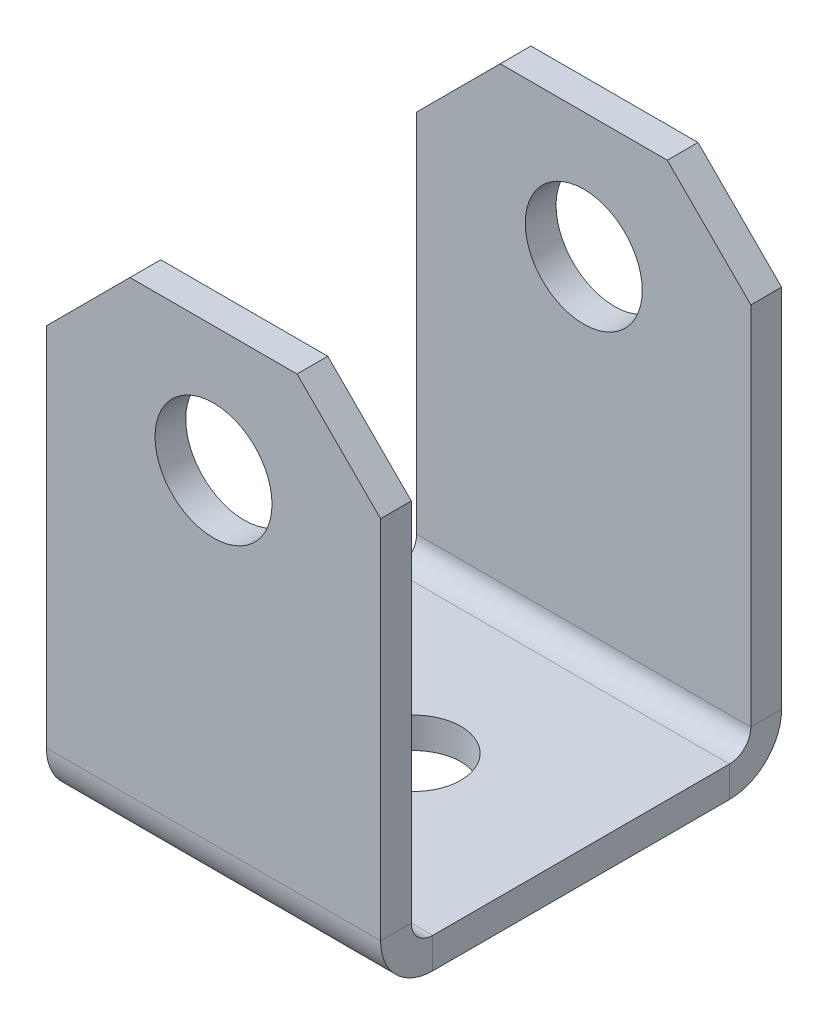
ISO-10303-21;
HEADER;
FILE_DESCRIPTION(('STEP AP214'),'2;1');
FILE_NAME('part.step','',(''),(''),'','','');
FILE_SCHEMA(('AUTOMOTIVE_DESIGN { 1 0 10303 214 1 1 1 1 }'));
ENDSEC;
DATA;
#1=APPLICATION_CONTEXT('core data for automotive mechanical design processes');
#2=APPLICATION_PROTOCOL_DEFINITION('international standard','automotive_design',2000,#1);
#3=PRODUCT_CONTEXT('',#1,'mechanical');
#4=PRODUCT('Part','Part','',(#3));
#5=PRODUCT_RELATED_PRODUCT_CATEGORY('part','',(#4));
#6=PRODUCT_DEFINITION_FORMATION('','',#4);
#7=PRODUCT_DEFINITION_CONTEXT('part definition',#1,'design');
#8=PRODUCT_DEFINITION('design','',#6,#7);
#9=PRODUCT_DEFINITION_SHAPE('','',#8);
#10=(LENGTH_UNIT() NAMED_UNIT(*) SI_UNIT(.MILLI.,.METRE.));
#11=(NAMED_UNIT(*) PLANE_ANGLE_UNIT() SI_UNIT($,.RADIAN.));
#12=(NAMED_UNIT(*) SI_UNIT($,.STERADIAN.) SOLID_ANGLE_UNIT());
#13=UNCERTAINTY_MEASURE_WITH_UNIT(LENGTH_MEASURE(1.E-05),#10,'distance_accuracy_value','');
#14=(GEOMETRIC_REPRESENTATION_CONTEXT(3) GLOBAL_UNCERTAINTY_ASSIGNED_CONTEXT((#13)) GLOBAL_UNIT_ASSIGNED_CONTEXT((#10,
#11,#12)) REPRESENTATION_CONTEXT('',''));
#15=CARTESIAN_POINT('',(0.,0.,0.));
#16=DIRECTION('',(0.,0.,1.));
#17=DIRECTION('',(1.,0.,0.));
#18=AXIS2_PLACEMENT_3D('',#15,#16,#17);
#19=CARTESIAN_POINT('',(-3.175,9.525,-7.62));
#20=DIRECTION('',(0.707106781186549,-0.707106781186546,0.));
#21=DIRECTION('',(0.,0.,-1.));
#22=AXIS2_PLACEMENT_3D('',#19,#20,#21);
#23=PLANE('',#22);
#24=DIRECTION('',(0.707106781186546,0.707106781186549,0.));
#25=VECTOR('',#24,1.);
#26=CARTESIAN_POINT('',(-3.175,9.525,-7.62));
#27=LINE('',#26,#25);
#28=CARTESIAN_POINT('',(-6.35,6.35,-7.62));
#29=VERTEX_POINT('',#28);
#30=CARTESIAN_POINT('',(-3.175,9.525,-7.62));
#31=VERTEX_POINT('',#30);
#32=EDGE_CURVE('E168',#29,#31,#27,.T.);
#33=ORIENTED_EDGE('',*,*,#32,.F.);
#34=DIRECTION('',(0.,0.,-1.));
#35=VECTOR('',#34,1.);
#36=CARTESIAN_POINT('',(-6.35,6.35,-7.62));
#37=LINE('',#36,#35);
#38=CARTESIAN_POINT('',(-6.35,6.35,-6.4516));
#39=VERTEX_POINT('',#38);
#40=EDGE_CURVE('E293',#39,#29,#37,.T.);
#41=ORIENTED_EDGE('',*,*,#40,.F.);
#42=DIRECTION('',(-0.707106781186546,-0.707106781186549,0.));
#43=VECTOR('',#42,1.);
#44=CARTESIAN_POINT('',(-13.7033,-1.00330000000004,-6.4516));
#45=LINE('',#44,#43);
#46=CARTESIAN_POINT('',(-3.175,9.525,-6.4516));
#47=VERTEX_POINT('',#46);
#48=EDGE_CURVE('E225',#47,#39,#45,.T.);
#49=ORIENTED_EDGE('',*,*,#48,.F.);
#50=DIRECTION('',(0.,0.,1.));
#51=VECTOR('',#50,1.);
#52=CARTESIAN_POINT('',(-3.175,9.525,-7.62));
#53=LINE('',#52,#51);
#54=EDGE_CURVE('E224',#31,#47,#53,.T.);
#55=ORIENTED_EDGE('',*,*,#54,.F.);
#56=EDGE_LOOP('',(#33,#41,#49,#55));
#57=FACE_BOUND('',#56,.T.);
#58=ADVANCED_FACE('F14',(#57),#23,.F.);
#59=CARTESIAN_POINT('',(-6.35,6.35,7.62));
#60=DIRECTION('',(0.707106781186546,-0.707106781186549,0.));
#61=DIRECTION('',(0.,0.,-1.));
#62=AXIS2_PLACEMENT_3D('',#59,#60,#61);
#63=PLANE('',#62);
#64=DIRECTION('',(-0.707106781186549,-0.707106781186546,0.));
#65=VECTOR('',#64,1.);
#66=CARTESIAN_POINT('',(-6.35,6.35,7.62));
#67=LINE('',#66,#65);
#68=CARTESIAN_POINT('',(-3.175,9.525,7.62));
#69=VERTEX_POINT('',#68);
#70=CARTESIAN_POINT('',(-6.35,6.35,7.62));
#71=VERTEX_POINT('',#70);
#72=EDGE_CURVE('E245',#69,#71,#67,.T.);
#73=ORIENTED_EDGE('',*,*,#72,.F.);
#74=DIRECTION('',(0.,0.,1.));
#75=VECTOR('',#74,1.);
#76=CARTESIAN_POINT('',(-3.175,9.525,7.62));
#77=LINE('',#76,#75);
#78=CARTESIAN_POINT('',(-3.175,9.525,6.4516));
#79=VERTEX_POINT('',#78);
#80=EDGE_CURVE('E9',#79,#69,#77,.T.);
#81=ORIENTED_EDGE('',*,*,#80,.F.);
#82=DIRECTION('',(0.707106781186549,0.707106781186546,0.));
#83=VECTOR('',#82,1.);
#84=CARTESIAN_POINT('',(-7.3533,5.3467,6.4516));
#85=LINE('',#84,#83);
#86=CARTESIAN_POINT('',(-6.35,6.35,6.4516));
#87=VERTEX_POINT('',#86);
#88=EDGE_CURVE('E181',#87,#79,#85,.T.);
#89=ORIENTED_EDGE('',*,*,#88,.F.);
#90=DIRECTION('',(0.,0.,-1.));
#91=VECTOR('',#90,1.);
#92=CARTESIAN_POINT('',(-6.35,6.35,7.62));
#93=LINE('',#92,#91);
#94=EDGE_CURVE('E219',#71,#87,#93,.T.);
#95=ORIENTED_EDGE('',*,*,#94,.F.);
#96=EDGE_LOOP('',(#73,#81,#89,#95));
#97=FACE_BOUND('',#96,.T.);
#98=ADVANCED_FACE('F522',(#97),#63,.F.);
#99=CARTESIAN_POINT('',(3.175,9.525,7.62));
#100=DIRECTION('',(-0.707106781186549,-0.707106781186546,0.));
#101=DIRECTION('',(-0.707106781186546,0.707106781186549,0.));
#102=AXIS2_PLACEMENT_3D('',#99,#100,#101);
#103=PLANE('',#102);
#104=DIRECTION('',(-0.707106781186546,0.707106781186549,0.));
#105=VECTOR('',#104,1.);
#106=CARTESIAN_POINT('',(3.175,9.525,7.62));
#107=LINE('',#106,#105);
#108=CARTESIAN_POINT('',(6.35,6.35,7.62));
#109=VERTEX_POINT('',#108);
#110=CARTESIAN_POINT('',(3.175,9.525,7.62));
#111=VERTEX_POINT('',#110);
#112=EDGE_CURVE('E218',#109,#111,#107,.T.);
#113=ORIENTED_EDGE('',*,*,#112,.F.);
#114=DIRECTION('',(0.,0.,1.));
#115=VECTOR('',#114,1.);
#116=CARTESIAN_POINT('',(6.35,6.35,7.62));
#117=LINE('',#116,#115);
#118=CARTESIAN_POINT('',(6.35,6.35,6.4516));
#119=VERTEX_POINT('',#118);
#120=EDGE_CURVE('E162',#119,#109,#117,.T.);
#121=ORIENTED_EDGE('',*,*,#120,.F.);
#122=DIRECTION('',(0.707106781186546,-0.707106781186549,0.));
#123=VECTOR('',#122,1.);
#124=CARTESIAN_POINT('',(13.7033,-1.00330000000003,6.4516));
#125=LINE('',#124,#123);
#126=CARTESIAN_POINT('',(3.175,9.525,6.4516));
#127=VERTEX_POINT('',#126);
#128=EDGE_CURVE('E240',#127,#119,#125,.T.);
#129=ORIENTED_EDGE('',*,*,#128,.F.);
#130=DIRECTION('',(0.,0.,-1.));
#131=VECTOR('',#130,1.);
#132=CARTESIAN_POINT('',(3.175,9.525,7.62));
#133=LINE('',#132,#131);
#134=EDGE_CURVE('E25',#111,#127,#133,.T.);
#135=ORIENTED_EDGE('',*,*,#134,.F.);
#136=EDGE_LOOP('',(#113,#121,#129,#135));
#137=FACE_BOUND('',#136,.T.);
#138=ADVANCED_FACE('F514',(#137),#103,.F.);
#139=CARTESIAN_POINT('',(6.35,6.35,-7.62));
#140=DIRECTION('',(-0.707106781186546,-0.707106781186549,0.));
#141=DIRECTION('',(-0.707106781186549,0.707106781186546,0.));
#142=AXIS2_PLACEMENT_3D('',#139,#140,#141);
#143=PLANE('',#142);
#144=DIRECTION('',(0.707106781186549,-0.707106781186546,0.));
#145=VECTOR('',#144,1.);
#146=CARTESIAN_POINT('',(6.35,6.35,-7.62));
#147=LINE('',#146,#145);
#148=CARTESIAN_POINT('',(3.175,9.525,-7.62));
#149=VERTEX_POINT('',#148);
#150=CARTESIAN_POINT('',(6.35,6.35,-7.62));
#151=VERTEX_POINT('',#150);
#152=EDGE_CURVE('E173',#149,#151,#147,.T.);
#153=ORIENTED_EDGE('',*,*,#152,.F.);
#154=DIRECTION('',(0.,0.,-1.));
#155=VECTOR('',#154,1.);
#156=CARTESIAN_POINT('',(3.175,9.525,-7.62));
#157=LINE('',#156,#155);
#158=CARTESIAN_POINT('',(3.175,9.525,-6.4516));
#159=VERTEX_POINT('',#158);
#160=EDGE_CURVE('E220',#159,#149,#157,.T.);
#161=ORIENTED_EDGE('',*,*,#160,.F.);
#162=DIRECTION('',(-0.707106781186549,0.707106781186546,0.));
#163=VECTOR('',#162,1.);
#164=CARTESIAN_POINT('',(7.3533,5.3467,-6.4516));
#165=LINE('',#164,#163);
#166=CARTESIAN_POINT('',(6.35,6.35,-6.4516));
#167=VERTEX_POINT('',#166);
#168=EDGE_CURVE('E172',#167,#159,#165,.T.);
#169=ORIENTED_EDGE('',*,*,#168,.F.);
#170=DIRECTION('',(0.,0.,1.));
#171=VECTOR('',#170,1.);
#172=CARTESIAN_POINT('',(6.35,6.35,-7.62));
#173=LINE('',#172,#171);
#174=EDGE_CURVE('E269',#151,#167,#173,.T.);
#175=ORIENTED_EDGE('',*,*,#174,.F.);
#176=EDGE_LOOP('',(#153,#161,#169,#175));
#177=FACE_BOUND('',#176,.T.);
#178=ADVANCED_FACE('F582',(#177),#143,.F.);
#179=CARTESIAN_POINT('',(-6.35,9.525,7.62));
#180=DIRECTION('',(0.,-1.,0.));
#181=DIRECTION('',(0.,0.,-1.));
#182=AXIS2_PLACEMENT_3D('',#179,#180,#181);
#183=PLANE('',#182);
#184=DIRECTION('',(-1.,0.,0.));
#185=VECTOR('',#184,1.);
#186=CARTESIAN_POINT('',(6.35,9.525,7.62));
#187=LINE('',#186,#185);
#188=EDGE_CURVE('E241',#111,#69,#187,.T.);
#189=ORIENTED_EDGE('',*,*,#188,.F.);
#190=ORIENTED_EDGE('',*,*,#134,.T.);
#191=DIRECTION('',(-1.,0.,0.));
#192=VECTOR('',#191,1.);
#193=CARTESIAN_POINT('',(-6.35,9.525,6.4516));
#194=LINE('',#193,#192);
#195=EDGE_CURVE('E304',#127,#79,#194,.T.);
#196=ORIENTED_EDGE('',*,*,#195,.T.);
#197=ORIENTED_EDGE('',*,*,#80,.T.);
#198=EDGE_LOOP('',(#189,#190,#196,#197));
#199=FACE_BOUND('',#198,.T.);
#200=ADVANCED_FACE('F517',(#199),#183,.F.);
#201=CARTESIAN_POINT('',(6.35,-8.3566,6.4516));
#202=DIRECTION('',(0.,0.,-1.));
#203=DIRECTION('',(0.,-1.,0.));
#204=AXIS2_PLACEMENT_3D('',#201,#202,#203);
#205=PLANE('',#204);
#206=CARTESIAN_POINT('',(0.,4.7625,6.4516));
#207=DIRECTION('',(0.,0.,-1.));
#208=DIRECTION('',(-1.,0.,0.));
#209=AXIS2_PLACEMENT_3D('',#206,#207,#208);
#210=CIRCLE('',#209,2.2225);
#211=CARTESIAN_POINT('',(2.2225,4.7625,6.4516));
#212=VERTEX_POINT('',#211);
#213=CARTESIAN_POINT('',(-2.2225,4.7625,6.4516));
#214=VERTEX_POINT('',#213);
#215=EDGE_CURVE('E185',#212,#214,#210,.T.);
#216=ORIENTED_EDGE('',*,*,#215,.F.);
#217=CARTESIAN_POINT('',(0.,4.7625,6.4516));
#218=DIRECTION('',(0.,0.,-1.));
#219=DIRECTION('',(-1.,0.,0.));
#220=AXIS2_PLACEMENT_3D('',#217,#218,#219);
#221=CIRCLE('',#220,2.2225);
#222=EDGE_CURVE('E263',#214,#212,#221,.T.);
#223=ORIENTED_EDGE('',*,*,#222,.F.);
#224=EDGE_LOOP('',(#216,#223));
#225=FACE_BOUND('',#224,.T.);
#226=ORIENTED_EDGE('',*,*,#195,.F.);
#227=ORIENTED_EDGE('',*,*,#128,.T.);
#228=DIRECTION('',(0.,1.,0.));
#229=VECTOR('',#228,1.);
#230=CARTESIAN_POINT('',(6.35,9.525,6.4516));
#231=LINE('',#230,#229);
#232=CARTESIAN_POINT('',(6.35,-7.5438,6.4516));
#233=VERTEX_POINT('',#232);
#234=EDGE_CURVE('E167',#233,#119,#231,.T.);
#235=ORIENTED_EDGE('',*,*,#234,.F.);
#236=DIRECTION('',(1.,0.,0.));
#237=VECTOR('',#236,1.);
#238=CARTESIAN_POINT('',(-6.35,-7.5438,6.4516));
#239=LINE('',#238,#237);
#240=CARTESIAN_POINT('',(-6.35,-7.5438,6.4516));
#241=VERTEX_POINT('',#240);
#242=EDGE_CURVE('E253',#241,#233,#239,.T.);
#243=ORIENTED_EDGE('',*,*,#242,.F.);
#244=DIRECTION('',(0.,-1.,0.));
#245=VECTOR('',#244,1.);
#246=CARTESIAN_POINT('',(-6.35,-8.3566,6.4516));
#247=LINE('',#246,#245);
#248=EDGE_CURVE('E214',#87,#241,#247,.T.);
#249=ORIENTED_EDGE('',*,*,#248,.F.);
#250=ORIENTED_EDGE('',*,*,#88,.T.);
#251=EDGE_LOOP('',(#226,#227,#235,#243,#249,#250));
#252=FACE_BOUND('',#251,.T.);
#253=ADVANCED_FACE('F504',(#225,#252),#205,.T.);
#254=CARTESIAN_POINT('',(6.35,-8.3566,7.62));
#255=DIRECTION('',(0.,0.,-1.));
#256=DIRECTION('',(0.,-1.,0.));
#257=AXIS2_PLACEMENT_3D('',#254,#255,#256);
#258=PLANE('',#257);
#259=CARTESIAN_POINT('',(0.,4.7625,7.62));
#260=DIRECTION('',(0.,0.,1.));
#261=DIRECTION('',(1.,0.,0.));
#262=AXIS2_PLACEMENT_3D('',#259,#260,#261);
#263=CIRCLE('',#262,2.2225);
#264=CARTESIAN_POINT('',(2.2225,4.7625,7.62));
#265=VERTEX_POINT('',#264);
#266=CARTESIAN_POINT('',(-2.2225,4.7625,7.62));
#267=VERTEX_POINT('',#266);
#268=EDGE_CURVE('E140',#265,#267,#263,.T.);
#269=ORIENTED_EDGE('',*,*,#268,.F.);
#270=CARTESIAN_POINT('',(0.,4.7625,7.62));
#271=DIRECTION('',(0.,0.,1.));
#272=DIRECTION('',(1.,0.,0.));
#273=AXIS2_PLACEMENT_3D('',#270,#271,#272);
#274=CIRCLE('',#273,2.2225);
#275=EDGE_CURVE('E136',#267,#265,#274,.T.);
#276=ORIENTED_EDGE('',*,*,#275,.F.);
#277=EDGE_LOOP('',(#269,#276));
#278=FACE_BOUND('',#277,.T.);
#279=DIRECTION('',(0.,1.,0.));
#280=VECTOR('',#279,1.);
#281=CARTESIAN_POINT('',(6.35,-8.3566,7.62));
#282=LINE('',#281,#280);
#283=CARTESIAN_POINT('',(6.35,-7.5438,7.62));
#284=VERTEX_POINT('',#283);
#285=EDGE_CURVE('E166',#284,#109,#282,.T.);
#286=ORIENTED_EDGE('',*,*,#285,.T.);
#287=ORIENTED_EDGE('',*,*,#112,.T.);
#288=ORIENTED_EDGE('',*,*,#188,.T.);
#289=ORIENTED_EDGE('',*,*,#72,.T.);
#290=DIRECTION('',(0.,-1.,0.));
#291=VECTOR('',#290,1.);
#292=CARTESIAN_POINT('',(-6.35,-8.3566,7.62));
#293=LINE('',#292,#291);
#294=CARTESIAN_POINT('',(-6.35,-7.5438,7.62));
#295=VERTEX_POINT('',#294);
#296=EDGE_CURVE('E289',#71,#295,#293,.T.);
#297=ORIENTED_EDGE('',*,*,#296,.T.);
#298=DIRECTION('',(-1.,0.,0.));
#299=VECTOR('',#298,1.);
#300=CARTESIAN_POINT('',(-6.35,-7.5438,7.62));
#301=LINE('',#300,#299);
#302=EDGE_CURVE('E209',#284,#295,#301,.T.);
#303=ORIENTED_EDGE('',*,*,#302,.F.);
#304=EDGE_LOOP('',(#286,#287,#288,#289,#297,#303));
#305=FACE_BOUND('',#304,.T.);
#306=ADVANCED_FACE('F507',(#278,#305),#258,.F.);
#307=CARTESIAN_POINT('',(-6.35,-8.3566,7.62));
#308=DIRECTION('',(1.,0.,0.));
#309=DIRECTION('',(0.,1.,0.));
#310=AXIS2_PLACEMENT_3D('',#307,#308,#309);
#311=PLANE('',#310);
#312=ORIENTED_EDGE('',*,*,#296,.F.);
#313=ORIENTED_EDGE('',*,*,#94,.T.);
#314=ORIENTED_EDGE('',*,*,#248,.T.);
#315=DIRECTION('',(0.,0.,1.));
#316=VECTOR('',#315,1.);
#317=CARTESIAN_POINT('',(-6.35,-7.5438,7.62));
#318=LINE('',#317,#316);
#319=EDGE_CURVE('E129',#241,#295,#318,.T.);
#320=ORIENTED_EDGE('',*,*,#319,.T.);
#321=EDGE_LOOP('',(#312,#313,#314,#320));
#322=FACE_BOUND('',#321,.T.);
#323=ADVANCED_FACE('F510',(#322),#311,.F.);
#324=CARTESIAN_POINT('',(6.35,9.525,7.62));
#325=DIRECTION('',(-1.,0.,0.));
#326=DIRECTION('',(0.,0.,1.));
#327=AXIS2_PLACEMENT_3D('',#324,#325,#326);
#328=PLANE('',#327);
#329=ORIENTED_EDGE('',*,*,#234,.T.);
#330=ORIENTED_EDGE('',*,*,#120,.T.);
#331=ORIENTED_EDGE('',*,*,#285,.F.);
#332=DIRECTION('',(0.,0.,1.));
#333=VECTOR('',#332,1.);
#334=CARTESIAN_POINT('',(6.35,-7.5438,6.4516));
#335=LINE('',#334,#333);
#336=EDGE_CURVE('E210',#233,#284,#335,.T.);
#337=ORIENTED_EDGE('',*,*,#336,.F.);
#338=EDGE_LOOP('',(#329,#330,#331,#337));
#339=FACE_BOUND('',#338,.T.);
#340=ADVANCED_FACE('F16',(#339),#328,.F.);
#341=CARTESIAN_POINT('',(6.35,-7.5438,5.6388));
#342=DIRECTION('',(1.,0.,0.));
#343=DIRECTION('',(0.,0.,1.));
#344=AXIS2_PLACEMENT_3D('',#341,#342,#343);
#345=CYLINDRICAL_SURFACE('',#344,0.8128);
#346=DIRECTION('',(1.,0.,0.));
#347=VECTOR('',#346,1.);
#348=CARTESIAN_POINT('',(-6.35,-8.3566,5.6388));
#349=LINE('',#348,#347);
#350=CARTESIAN_POINT('',(-6.35,-8.3566,5.6388));
#351=VERTEX_POINT('',#350);
#352=CARTESIAN_POINT('',(6.35,-8.3566,5.6388));
#353=VERTEX_POINT('',#352);
#354=EDGE_CURVE('E123',#351,#353,#349,.T.);
#355=ORIENTED_EDGE('',*,*,#354,.F.);
#356=CARTESIAN_POINT('',(-6.35,-7.5438,5.6388));
#357=DIRECTION('',(-1.,0.,0.));
#358=DIRECTION('',(0.,0.,-1.));
#359=AXIS2_PLACEMENT_3D('',#356,#357,#358);
#360=CIRCLE('',#359,0.8128);
#361=EDGE_CURVE('E124',#351,#241,#360,.T.);
#362=ORIENTED_EDGE('',*,*,#361,.T.);
#363=ORIENTED_EDGE('',*,*,#242,.T.);
#364=CARTESIAN_POINT('',(6.35,-7.5438,5.6388));
#365=DIRECTION('',(1.,0.,0.));
#366=DIRECTION('',(0.,0.,-1.));
#367=AXIS2_PLACEMENT_3D('',#364,#365,#366);
#368=CIRCLE('',#367,0.8128);
#369=EDGE_CURVE('E246',#233,#353,#368,.T.);
#370=ORIENTED_EDGE('',*,*,#369,.T.);
#371=EDGE_LOOP('',(#355,#362,#363,#370));
#372=FACE_BOUND('',#371,.T.);
#373=ADVANCED_FACE('F596',(#372),#345,.F.);
#374=CARTESIAN_POINT('',(6.35,-7.5438,5.6388));
#375=DIRECTION('',(1.,0.,0.));
#376=DIRECTION('',(0.,0.,1.));
#377=AXIS2_PLACEMENT_3D('',#374,#375,#376);
#378=CYLINDRICAL_SURFACE('',#377,1.9812);
#379=DIRECTION('',(1.,0.,0.));
#380=VECTOR('',#379,1.);
#381=CARTESIAN_POINT('',(-6.35,-9.525,5.6388));
#382=LINE('',#381,#380);
#383=CARTESIAN_POINT('',(-6.35,-9.525,5.6388));
#384=VERTEX_POINT('',#383);
#385=CARTESIAN_POINT('',(6.35,-9.525,5.6388));
#386=VERTEX_POINT('',#385);
#387=EDGE_CURVE('E155',#384,#386,#382,.T.);
#388=ORIENTED_EDGE('',*,*,#387,.T.);
#389=CARTESIAN_POINT('',(6.35,-7.5438,5.6388));
#390=DIRECTION('',(1.,0.,0.));
#391=DIRECTION('',(0.,0.,-1.));
#392=AXIS2_PLACEMENT_3D('',#389,#390,#391);
#393=CIRCLE('',#392,1.9812);
#394=EDGE_CURVE('E205',#284,#386,#393,.T.);
#395=ORIENTED_EDGE('',*,*,#394,.F.);
#396=ORIENTED_EDGE('',*,*,#302,.T.);
#397=CARTESIAN_POINT('',(-6.35,-7.5438,5.6388));
#398=DIRECTION('',(-1.,0.,0.));
#399=DIRECTION('',(0.,0.,-1.));
#400=AXIS2_PLACEMENT_3D('',#397,#398,#399);
#401=CIRCLE('',#400,1.9812);
#402=EDGE_CURVE('E128',#384,#295,#401,.T.);
#403=ORIENTED_EDGE('',*,*,#402,.F.);
#404=EDGE_LOOP('',(#388,#395,#396,#403));
#405=FACE_BOUND('',#404,.T.);
#406=ADVANCED_FACE('F578',(#405),#378,.T.);
#407=CARTESIAN_POINT('',(6.35,-7.5438,5.6388));
#408=DIRECTION('',(-1.,0.,0.));
#409=DIRECTION('',(0.,0.,1.));
#410=AXIS2_PLACEMENT_3D('',#407,#408,#409);
#411=PLANE('',#410);
#412=ORIENTED_EDGE('',*,*,#369,.F.);
#413=ORIENTED_EDGE('',*,*,#336,.T.);
#414=ORIENTED_EDGE('',*,*,#394,.T.);
#415=DIRECTION('',(0.,-1.,0.));
#416=VECTOR('',#415,1.);
#417=CARTESIAN_POINT('',(6.35,-8.3566,5.6388));
#418=LINE('',#417,#416);
#419=EDGE_CURVE('E117',#353,#386,#418,.T.);
#420=ORIENTED_EDGE('',*,*,#419,.F.);
#421=EDGE_LOOP('',(#412,#413,#414,#420));
#422=FACE_BOUND('',#421,.T.);
#423=ADVANCED_FACE('F575',(#422),#411,.F.);
#424=CARTESIAN_POINT('',(-6.35,-7.5438,5.6388));
#425=DIRECTION('',(-1.,0.,0.));
#426=DIRECTION('',(0.,0.,1.));
#427=AXIS2_PLACEMENT_3D('',#424,#425,#426);
#428=PLANE('',#427);
#429=ORIENTED_EDGE('',*,*,#319,.F.);
#430=ORIENTED_EDGE('',*,*,#361,.F.);
#431=DIRECTION('',(0.,-1.,0.));
#432=VECTOR('',#431,1.);
#433=CARTESIAN_POINT('',(-6.35,-8.3566,5.6388));
#434=LINE('',#433,#432);
#435=EDGE_CURVE('E135',#351,#384,#434,.T.);
#436=ORIENTED_EDGE('',*,*,#435,.T.);
#437=ORIENTED_EDGE('',*,*,#402,.T.);
#438=EDGE_LOOP('',(#429,#430,#436,#437));
#439=FACE_BOUND('',#438,.T.);
#440=ADVANCED_FACE('F527',(#439),#428,.T.);
#441=CARTESIAN_POINT('',(6.35,9.525,-7.62));
#442=DIRECTION('',(0.,-1.,0.));
#443=DIRECTION('',(-1.,0.,0.));
#444=AXIS2_PLACEMENT_3D('',#441,#442,#443);
#445=PLANE('',#444);
#446=DIRECTION('',(1.,0.,0.));
#447=VECTOR('',#446,1.);
#448=CARTESIAN_POINT('',(6.35,9.525,-6.4516));
#449=LINE('',#448,#447);
#450=EDGE_CURVE('E18',#47,#159,#449,.T.);
#451=ORIENTED_EDGE('',*,*,#450,.T.);
#452=ORIENTED_EDGE('',*,*,#160,.T.);
#453=DIRECTION('',(1.,0.,0.));
#454=VECTOR('',#453,1.);
#455=CARTESIAN_POINT('',(-6.35,9.525,-7.62));
#456=LINE('',#455,#454);
#457=EDGE_CURVE('E314',#31,#149,#456,.T.);
#458=ORIENTED_EDGE('',*,*,#457,.F.);
#459=ORIENTED_EDGE('',*,*,#54,.T.);
#460=EDGE_LOOP('',(#451,#452,#458,#459));
#461=FACE_BOUND('',#460,.T.);
#462=ADVANCED_FACE('F351',(#461),#445,.F.);
#463=CARTESIAN_POINT('',(-6.35,-8.3566,-6.4516));
#464=DIRECTION('',(0.,0.,1.));
#465=DIRECTION('',(0.,-1.,0.));
#466=AXIS2_PLACEMENT_3D('',#463,#464,#465);
#467=PLANE('',#466);
#468=CARTESIAN_POINT('',(0.,4.7625,-6.4516));
#469=DIRECTION('',(0.,0.,1.));
#470=DIRECTION('',(0.,-1.,0.));
#471=AXIS2_PLACEMENT_3D('',#468,#469,#470);
#472=CIRCLE('',#471,2.2225);
#473=CARTESIAN_POINT('',(2.2225,4.7625,-6.4516));
#474=VERTEX_POINT('',#473);
#475=CARTESIAN_POINT('',(-2.2225,4.7625,-6.4516));
#476=VERTEX_POINT('',#475);
#477=EDGE_CURVE('E182',#474,#476,#472,.T.);
#478=ORIENTED_EDGE('',*,*,#477,.F.);
#479=CARTESIAN_POINT('',(0.,4.7625,-6.4516));
#480=DIRECTION('',(0.,0.,1.));
#481=DIRECTION('',(0.,-1.,0.));
#482=AXIS2_PLACEMENT_3D('',#479,#480,#481);
#483=CIRCLE('',#482,2.2225);
#484=EDGE_CURVE('E186',#476,#474,#483,.T.);
#485=ORIENTED_EDGE('',*,*,#484,.F.);
#486=EDGE_LOOP('',(#478,#485));
#487=FACE_BOUND('',#486,.T.);
#488=DIRECTION('',(0.,-1.,0.));
#489=VECTOR('',#488,1.);
#490=CARTESIAN_POINT('',(6.35,-8.3566,-6.4516));
#491=LINE('',#490,#489);
#492=CARTESIAN_POINT('',(6.35,-7.5438,-6.4516));
#493=VERTEX_POINT('',#492);
#494=EDGE_CURVE('E273',#167,#493,#491,.T.);
#495=ORIENTED_EDGE('',*,*,#494,.F.);
#496=ORIENTED_EDGE('',*,*,#168,.T.);
#497=ORIENTED_EDGE('',*,*,#450,.F.);
#498=ORIENTED_EDGE('',*,*,#48,.T.);
#499=DIRECTION('',(0.,1.,0.));
#500=VECTOR('',#499,1.);
#501=CARTESIAN_POINT('',(-6.35,9.525,-6.4516));
#502=LINE('',#501,#500);
#503=CARTESIAN_POINT('',(-6.35,-7.5438,-6.4516));
#504=VERTEX_POINT('',#503);
#505=EDGE_CURVE('E160',#504,#39,#502,.T.);
#506=ORIENTED_EDGE('',*,*,#505,.F.);
#507=DIRECTION('',(-1.,0.,0.));
#508=VECTOR('',#507,1.);
#509=CARTESIAN_POINT('',(6.35,-7.5438,-6.4516));
#510=LINE('',#509,#508);
#511=EDGE_CURVE('E156',#493,#504,#510,.T.);
#512=ORIENTED_EDGE('',*,*,#511,.F.);
#513=EDGE_LOOP('',(#495,#496,#497,#498,#506,#512));
#514=FACE_BOUND('',#513,.T.);
#515=ADVANCED_FACE('F359',(#487,#514),#467,.T.);
#516=CARTESIAN_POINT('',(-6.35,-8.3566,-7.62));
#517=DIRECTION('',(0.,0.,1.));
#518=DIRECTION('',(0.,-1.,0.));
#519=AXIS2_PLACEMENT_3D('',#516,#517,#518);
#520=PLANE('',#519);
#521=CARTESIAN_POINT('',(0.,4.7625,-7.62));
#522=DIRECTION('',(0.,0.,1.));
#523=DIRECTION('',(1.,0.,0.));
#524=AXIS2_PLACEMENT_3D('',#521,#522,#523);
#525=CIRCLE('',#524,2.2225);
#526=CARTESIAN_POINT('',(2.2225,4.7625,-7.62));
#527=VERTEX_POINT('',#526);
#528=CARTESIAN_POINT('',(-2.2225,4.7625,-7.62));
#529=VERTEX_POINT('',#528);
#530=EDGE_CURVE('E103',#527,#529,#525,.T.);
#531=ORIENTED_EDGE('',*,*,#530,.T.);
#532=CARTESIAN_POINT('',(0.,4.7625,-7.62));
#533=DIRECTION('',(0.,0.,1.));
#534=DIRECTION('',(1.,0.,0.));
#535=AXIS2_PLACEMENT_3D('',#532,#533,#534);
#536=CIRCLE('',#535,2.2225);
#537=EDGE_CURVE('E99',#529,#527,#536,.T.);
#538=ORIENTED_EDGE('',*,*,#537,.T.);
#539=EDGE_LOOP('',(#531,#538));
#540=FACE_BOUND('',#539,.T.);
#541=ORIENTED_EDGE('',*,*,#457,.T.);
#542=ORIENTED_EDGE('',*,*,#152,.T.);
#543=DIRECTION('',(0.,-1.,0.));
#544=VECTOR('',#543,1.);
#545=CARTESIAN_POINT('',(6.35,-8.3566,-7.62));
#546=LINE('',#545,#544);
#547=CARTESIAN_POINT('',(6.35,-7.5438,-7.62));
#548=VERTEX_POINT('',#547);
#549=EDGE_CURVE('E274',#151,#548,#546,.T.);
#550=ORIENTED_EDGE('',*,*,#549,.T.);
#551=DIRECTION('',(1.,0.,0.));
#552=VECTOR('',#551,1.);
#553=CARTESIAN_POINT('',(6.35,-7.5438,-7.62));
#554=LINE('',#553,#552);
#555=CARTESIAN_POINT('',(-6.35,-7.5438,-7.62));
#556=VERTEX_POINT('',#555);
#557=EDGE_CURVE('E161',#556,#548,#554,.T.);
#558=ORIENTED_EDGE('',*,*,#557,.F.);
#559=DIRECTION('',(0.,1.,0.));
#560=VECTOR('',#559,1.);
#561=CARTESIAN_POINT('',(-6.35,-8.3566,-7.62));
#562=LINE('',#561,#560);
#563=EDGE_CURVE('E297',#556,#29,#562,.T.);
#564=ORIENTED_EDGE('',*,*,#563,.T.);
#565=ORIENTED_EDGE('',*,*,#32,.T.);
#566=EDGE_LOOP('',(#541,#542,#550,#558,#564,#565));
#567=FACE_BOUND('',#566,.T.);
#568=ADVANCED_FACE('F101',(#540,#567),#520,.F.);
#569=CARTESIAN_POINT('',(6.35,-8.3566,-7.62));
#570=DIRECTION('',(-1.,0.,0.));
#571=DIRECTION('',(0.,1.,0.));
#572=AXIS2_PLACEMENT_3D('',#569,#570,#571);
#573=PLANE('',#572);
#574=ORIENTED_EDGE('',*,*,#549,.F.);
#575=ORIENTED_EDGE('',*,*,#174,.T.);
#576=ORIENTED_EDGE('',*,*,#494,.T.);
#577=DIRECTION('',(0.,0.,-1.));
#578=VECTOR('',#577,1.);
#579=CARTESIAN_POINT('',(6.35,-7.5438,-7.62));
#580=LINE('',#579,#578);
#581=EDGE_CURVE('E150',#493,#548,#580,.T.);
#582=ORIENTED_EDGE('',*,*,#581,.T.);
#583=EDGE_LOOP('',(#574,#575,#576,#582));
#584=FACE_BOUND('',#583,.T.);
#585=ADVANCED_FACE('F461',(#584),#573,.F.);
#586=CARTESIAN_POINT('',(-6.35,9.525,-7.62));
#587=DIRECTION('',(1.,0.,0.));
#588=DIRECTION('',(0.,1.,0.));
#589=AXIS2_PLACEMENT_3D('',#586,#587,#588);
#590=PLANE('',#589);
#591=ORIENTED_EDGE('',*,*,#505,.T.);
#592=ORIENTED_EDGE('',*,*,#40,.T.);
#593=ORIENTED_EDGE('',*,*,#563,.F.);
#594=DIRECTION('',(0.,0.,-1.));
#595=VECTOR('',#594,1.);
#596=CARTESIAN_POINT('',(-6.35,-7.5438,-6.4516));
#597=LINE('',#596,#595);
#598=EDGE_CURVE('E279',#504,#556,#597,.T.);
#599=ORIENTED_EDGE('',*,*,#598,.F.);
#600=EDGE_LOOP('',(#591,#592,#593,#599));
#601=FACE_BOUND('',#600,.T.);
#602=ADVANCED_FACE('F608',(#601),#590,.F.);
#603=CARTESIAN_POINT('',(-6.35,-7.5438,-5.6388));
#604=DIRECTION('',(-1.,0.,0.));
#605=DIRECTION('',(0.,0.,-1.));
#606=AXIS2_PLACEMENT_3D('',#603,#604,#605);
#607=CYLINDRICAL_SURFACE('',#606,0.8128);
#608=DIRECTION('',(-1.,0.,0.));
#609=VECTOR('',#608,1.);
#610=CARTESIAN_POINT('',(-6.35,-8.3566,-5.6388));
#611=LINE('',#610,#609);
#612=CARTESIAN_POINT('',(6.35,-8.3566,-5.6388));
#613=VERTEX_POINT('',#612);
#614=CARTESIAN_POINT('',(-6.35,-8.3566,-5.6388));
#615=VERTEX_POINT('',#614);
#616=EDGE_CURVE('E119',#613,#615,#611,.T.);
#617=ORIENTED_EDGE('',*,*,#616,.F.);
#618=CARTESIAN_POINT('',(6.35,-7.5438,-5.6388));
#619=DIRECTION('',(1.,0.,0.));
#620=DIRECTION('',(0.,0.,1.));
#621=AXIS2_PLACEMENT_3D('',#618,#619,#620);
#622=CIRCLE('',#621,0.8128);
#623=EDGE_CURVE('E154',#613,#493,#622,.T.);
#624=ORIENTED_EDGE('',*,*,#623,.T.);
#625=ORIENTED_EDGE('',*,*,#511,.T.);
#626=CARTESIAN_POINT('',(-6.35,-7.5438,-5.6388));
#627=DIRECTION('',(-1.,0.,0.));
#628=DIRECTION('',(0.,0.,1.));
#629=AXIS2_PLACEMENT_3D('',#626,#627,#628);
#630=CIRCLE('',#629,0.8128);
#631=EDGE_CURVE('E201',#504,#615,#630,.T.);
#632=ORIENTED_EDGE('',*,*,#631,.T.);
#633=EDGE_LOOP('',(#617,#624,#625,#632));
#634=FACE_BOUND('',#633,.T.);
#635=ADVANCED_FACE('F466',(#634),#607,.F.);
#636=CARTESIAN_POINT('',(-6.35,-7.5438,-5.6388));
#637=DIRECTION('',(-1.,0.,0.));
#638=DIRECTION('',(0.,0.,-1.));
#639=AXIS2_PLACEMENT_3D('',#636,#637,#638);
#640=CYLINDRICAL_SURFACE('',#639,1.9812);
#641=DIRECTION('',(-1.,0.,0.));
#642=VECTOR('',#641,1.);
#643=CARTESIAN_POINT('',(-6.35,-9.525,-5.6388));
#644=LINE('',#643,#642);
#645=CARTESIAN_POINT('',(6.35,-9.525,-5.6388));
#646=VERTEX_POINT('',#645);
#647=CARTESIAN_POINT('',(-6.35,-9.525,-5.6388));
#648=VERTEX_POINT('',#647);
#649=EDGE_CURVE('E122',#646,#648,#644,.T.);
#650=ORIENTED_EDGE('',*,*,#649,.T.);
#651=CARTESIAN_POINT('',(-6.35,-7.5438,-5.6388));
#652=DIRECTION('',(-1.,0.,0.));
#653=DIRECTION('',(0.,0.,1.));
#654=AXIS2_PLACEMENT_3D('',#651,#652,#653);
#655=CIRCLE('',#654,1.9812);
#656=EDGE_CURVE('E275',#556,#648,#655,.T.);
#657=ORIENTED_EDGE('',*,*,#656,.F.);
#658=ORIENTED_EDGE('',*,*,#557,.T.);
#659=CARTESIAN_POINT('',(6.35,-7.5438,-5.6388));
#660=DIRECTION('',(1.,0.,0.));
#661=DIRECTION('',(0.,0.,1.));
#662=AXIS2_PLACEMENT_3D('',#659,#660,#661);
#663=CIRCLE('',#662,1.9812);
#664=EDGE_CURVE('E197',#646,#548,#663,.T.);
#665=ORIENTED_EDGE('',*,*,#664,.F.);
#666=EDGE_LOOP('',(#650,#657,#658,#665));
#667=FACE_BOUND('',#666,.T.);
#668=ADVANCED_FACE('F453',(#667),#640,.T.);
#669=CARTESIAN_POINT('',(-6.35,-7.5438,-5.6388));
#670=DIRECTION('',(1.,0.,0.));
#671=DIRECTION('',(0.,1.,0.));
#672=AXIS2_PLACEMENT_3D('',#669,#670,#671);
#673=PLANE('',#672);
#674=ORIENTED_EDGE('',*,*,#631,.F.);
#675=ORIENTED_EDGE('',*,*,#598,.T.);
#676=ORIENTED_EDGE('',*,*,#656,.T.);
#677=DIRECTION('',(0.,-1.,0.));
#678=VECTOR('',#677,1.);
#679=CARTESIAN_POINT('',(-6.35,-8.3566,-5.6388));
#680=LINE('',#679,#678);
#681=EDGE_CURVE('E134',#615,#648,#680,.T.);
#682=ORIENTED_EDGE('',*,*,#681,.F.);
#683=EDGE_LOOP('',(#674,#675,#676,#682));
#684=FACE_BOUND('',#683,.T.);
#685=ADVANCED_FACE('F567',(#684),#673,.F.);
#686=CARTESIAN_POINT('',(6.35,-7.5438,-5.6388));
#687=DIRECTION('',(1.,0.,0.));
#688=DIRECTION('',(0.,1.,0.));
#689=AXIS2_PLACEMENT_3D('',#686,#687,#688);
#690=PLANE('',#689);
#691=ORIENTED_EDGE('',*,*,#581,.F.);
#692=ORIENTED_EDGE('',*,*,#623,.F.);
#693=DIRECTION('',(0.,-1.,0.));
#694=VECTOR('',#693,1.);
#695=CARTESIAN_POINT('',(6.35,-8.3566,-5.6388));
#696=LINE('',#695,#694);
#697=EDGE_CURVE('E178',#613,#646,#696,.T.);
#698=ORIENTED_EDGE('',*,*,#697,.T.);
#699=ORIENTED_EDGE('',*,*,#664,.T.);
#700=EDGE_LOOP('',(#691,#692,#698,#699));
#701=FACE_BOUND('',#700,.T.);
#702=ADVANCED_FACE('F458',(#701),#690,.T.);
#703=CARTESIAN_POINT('',(-6.35,-9.525,5.6388));
#704=DIRECTION('',(0.,1.,0.));
#705=DIRECTION('',(1.,0.,0.));
#706=AXIS2_PLACEMENT_3D('',#703,#704,#705);
#707=PLANE('',#706);
#708=CARTESIAN_POINT('',(0.,-9.525,0.));
#709=DIRECTION('',(0.,1.,0.));
#710=DIRECTION('',(0.,0.,1.));
#711=AXIS2_PLACEMENT_3D('',#708,#709,#710);
#712=CIRCLE('',#711,1.778);
#713=CARTESIAN_POINT('',(0.,-9.525,1.778));
#714=VERTEX_POINT('',#713);
#715=CARTESIAN_POINT('',(0.,-9.525,-1.778));
#716=VERTEX_POINT('',#715);
#717=EDGE_CURVE('E192',#714,#716,#712,.T.);
#718=ORIENTED_EDGE('',*,*,#717,.T.);
#719=CARTESIAN_POINT('',(0.,-9.525,0.));
#720=DIRECTION('',(0.,1.,0.));
#721=DIRECTION('',(0.,0.,1.));
#722=AXIS2_PLACEMENT_3D('',#719,#720,#721);
#723=CIRCLE('',#722,1.778);
#724=EDGE_CURVE('E187',#716,#714,#723,.T.);
#725=ORIENTED_EDGE('',*,*,#724,.T.);
#726=EDGE_LOOP('',(#718,#725));
#727=FACE_BOUND('',#726,.T.);
#728=DIRECTION('',(0.,0.,1.));
#729=VECTOR('',#728,1.);
#730=CARTESIAN_POINT('',(-6.35,-9.525,-5.6388));
#731=LINE('',#730,#729);
#732=EDGE_CURVE('E149',#648,#384,#731,.T.);
#733=ORIENTED_EDGE('',*,*,#732,.F.);
#734=ORIENTED_EDGE('',*,*,#649,.F.);
#735=DIRECTION('',(0.,0.,-1.));
#736=VECTOR('',#735,1.);
#737=CARTESIAN_POINT('',(6.35,-9.525,-5.6388));
#738=LINE('',#737,#736);
#739=EDGE_CURVE('E145',#386,#646,#738,.T.);
#740=ORIENTED_EDGE('',*,*,#739,.F.);
#741=ORIENTED_EDGE('',*,*,#387,.F.);
#742=EDGE_LOOP('',(#733,#734,#740,#741));
#743=FACE_BOUND('',#742,.T.);
#744=ADVANCED_FACE('F583',(#727,#743),#707,.F.);
#745=CARTESIAN_POINT('',(-6.35,-8.3566,5.6388));
#746=DIRECTION('',(0.,1.,0.));
#747=DIRECTION('',(1.,0.,0.));
#748=AXIS2_PLACEMENT_3D('',#745,#746,#747);
#749=PLANE('',#748);
#750=CARTESIAN_POINT('',(0.,-8.3566,0.));
#751=DIRECTION('',(0.,1.,0.));
#752=DIRECTION('',(0.,0.,1.));
#753=AXIS2_PLACEMENT_3D('',#750,#751,#752);
#754=CIRCLE('',#753,1.778);
#755=CARTESIAN_POINT('',(0.,-8.3566,1.778));
#756=VERTEX_POINT('',#755);
#757=CARTESIAN_POINT('',(0.,-8.3566,-1.778));
#758=VERTEX_POINT('',#757);
#759=EDGE_CURVE('E196',#756,#758,#754,.T.);
#760=ORIENTED_EDGE('',*,*,#759,.F.);
#761=CARTESIAN_POINT('',(0.,-8.3566,0.));
#762=DIRECTION('',(0.,1.,0.));
#763=DIRECTION('',(0.,0.,1.));
#764=AXIS2_PLACEMENT_3D('',#761,#762,#763);
#765=CIRCLE('',#764,1.778);
#766=EDGE_CURVE('E228',#758,#756,#765,.T.);
#767=ORIENTED_EDGE('',*,*,#766,.F.);
#768=EDGE_LOOP('',(#760,#767));
#769=FACE_BOUND('',#768,.T.);
#770=DIRECTION('',(0.,0.,1.));
#771=VECTOR('',#770,1.);
#772=CARTESIAN_POINT('',(-6.35,-8.3566,-5.6388));
#773=LINE('',#772,#771);
#774=EDGE_CURVE('E130',#615,#351,#773,.T.);
#775=ORIENTED_EDGE('',*,*,#774,.T.);
#776=ORIENTED_EDGE('',*,*,#354,.T.);
#777=DIRECTION('',(0.,0.,-1.));
#778=VECTOR('',#777,1.);
#779=CARTESIAN_POINT('',(6.35,-8.3566,-5.6388));
#780=LINE('',#779,#778);
#781=EDGE_CURVE('E174',#353,#613,#780,.T.);
#782=ORIENTED_EDGE('',*,*,#781,.T.);
#783=ORIENTED_EDGE('',*,*,#616,.T.);
#784=EDGE_LOOP('',(#775,#776,#782,#783));
#785=FACE_BOUND('',#784,.T.);
#786=ADVANCED_FACE('F471',(#769,#785),#749,.T.);
#787=CARTESIAN_POINT('',(6.35,-8.3566,-5.6388));
#788=DIRECTION('',(-1.,0.,0.));
#789=DIRECTION('',(0.,1.,0.));
#790=AXIS2_PLACEMENT_3D('',#787,#788,#789);
#791=PLANE('',#790);
#792=ORIENTED_EDGE('',*,*,#739,.T.);
#793=ORIENTED_EDGE('',*,*,#697,.F.);
#794=ORIENTED_EDGE('',*,*,#781,.F.);
#795=ORIENTED_EDGE('',*,*,#419,.T.);
#796=EDGE_LOOP('',(#792,#793,#794,#795));
#797=FACE_BOUND('',#796,.T.);
#798=ADVANCED_FACE('F476',(#797),#791,.F.);
#799=CARTESIAN_POINT('',(-6.35,-8.3566,-5.6388));
#800=DIRECTION('',(1.,0.,0.));
#801=DIRECTION('',(0.,0.,-1.));
#802=AXIS2_PLACEMENT_3D('',#799,#800,#801);
#803=PLANE('',#802);
#804=ORIENTED_EDGE('',*,*,#732,.T.);
#805=ORIENTED_EDGE('',*,*,#435,.F.);
#806=ORIENTED_EDGE('',*,*,#774,.F.);
#807=ORIENTED_EDGE('',*,*,#681,.T.);
#808=EDGE_LOOP('',(#804,#805,#806,#807));
#809=FACE_BOUND('',#808,.T.);
#810=ADVANCED_FACE('F571',(#809),#803,.F.);
#811=CARTESIAN_POINT('',(0.,-10.8966,0.));
#812=DIRECTION('',(0.,1.,0.));
#813=DIRECTION('',(0.,0.,1.));
#814=AXIS2_PLACEMENT_3D('',#811,#812,#813);
#815=CYLINDRICAL_SURFACE('',#814,1.778);
#816=ORIENTED_EDGE('',*,*,#717,.F.);
#817=ORIENTED_EDGE('',*,*,#724,.F.);
#818=DIRECTION('',(0.,1.,0.));
#819=VECTOR('',#818,1.);
#820=CARTESIAN_POINT('',(0.,-10.8966,-1.778));
#821=LINE('',#820,#819);
#822=EDGE_CURVE('E191',#716,#758,#821,.T.);
#823=ORIENTED_EDGE('',*,*,#822,.T.);
#824=ORIENTED_EDGE('',*,*,#766,.T.);
#825=ORIENTED_EDGE('',*,*,#759,.T.);
#826=ORIENTED_EDGE('',*,*,#822,.F.);
#827=EDGE_LOOP('',(#816,#817,#823,#824,#825,#826));
#828=FACE_BOUND('',#827,.T.);
#829=ADVANCED_FACE('F568',(#828),#815,.F.);
#830=CARTESIAN_POINT('',(0.,4.7625,-7.62));
#831=DIRECTION('',(0.,0.,1.));
#832=DIRECTION('',(1.,0.,0.));
#833=AXIS2_PLACEMENT_3D('',#830,#831,#832);
#834=CYLINDRICAL_SURFACE('',#833,2.2225);
#835=ORIENTED_EDGE('',*,*,#215,.T.);
#836=DIRECTION('',(0.,0.,1.));
#837=VECTOR('',#836,1.);
#838=CARTESIAN_POINT('',(-2.2225,4.7625,-7.62));
#839=LINE('',#838,#837);
#840=EDGE_CURVE('E141',#214,#267,#839,.T.);
#841=ORIENTED_EDGE('',*,*,#840,.T.);
#842=ORIENTED_EDGE('',*,*,#275,.T.);
#843=ORIENTED_EDGE('',*,*,#268,.T.);
#844=ORIENTED_EDGE('',*,*,#840,.F.);
#845=ORIENTED_EDGE('',*,*,#222,.T.);
#846=EDGE_LOOP('',(#835,#841,#842,#843,#844,#845));
#847=FACE_BOUND('',#846,.T.);
#848=ADVANCED_FACE('F501',(#847),#834,.F.);
#849=CARTESIAN_POINT('',(0.,4.7625,-7.62));
#850=DIRECTION('',(0.,0.,1.));
#851=DIRECTION('',(1.,0.,0.));
#852=AXIS2_PLACEMENT_3D('',#849,#850,#851);
#853=CYLINDRICAL_SURFACE('',#852,2.2225);
#854=ORIENTED_EDGE('',*,*,#530,.F.);
#855=ORIENTED_EDGE('',*,*,#537,.F.);
#856=DIRECTION('',(0.,0.,1.));
#857=VECTOR('',#856,1.);
#858=CARTESIAN_POINT('',(-2.2225,4.7625,-7.62));
#859=LINE('',#858,#857);
#860=EDGE_CURVE('E107',#529,#476,#859,.T.);
#861=ORIENTED_EDGE('',*,*,#860,.T.);
#862=ORIENTED_EDGE('',*,*,#484,.T.);
#863=ORIENTED_EDGE('',*,*,#477,.T.);
#864=ORIENTED_EDGE('',*,*,#860,.F.);
#865=EDGE_LOOP('',(#854,#855,#861,#862,#863,#864));
#866=FACE_BOUND('',#865,.T.);
#867=ADVANCED_FACE('F109',(#866),#853,.F.);
#868=CLOSED_SHELL('',(#58,#98,#138,#178,#200,#253,#306,#323,#340,#373,#406,#423,#440,#462,#515,
#568,#585,#602,#635,#668,#685,#702,#744,#786,#798,#810,#829,#848,#867));
#869=MANIFOLD_SOLID_BREP('B1',#868);
#870=ADVANCED_BREP_SHAPE_REPRESENTATION('',(#18,#869),#14);
#871=SHAPE_DEFINITION_REPRESENTATION(#9,#870);
ENDSEC;
END-ISO-10303-21;
